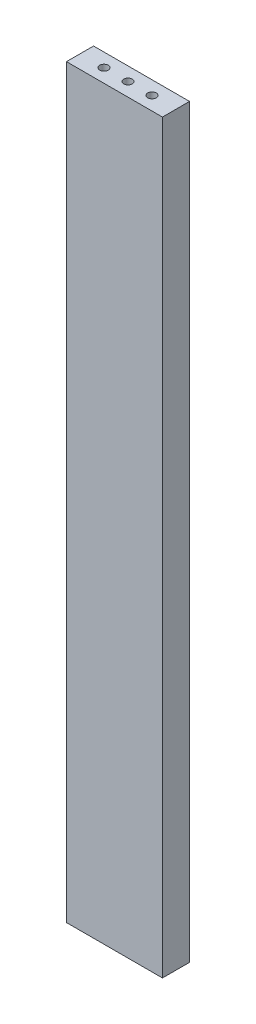
ISO-10303-21;
HEADER;
FILE_DESCRIPTION(('STEP AP214'),'2;1');
FILE_NAME('part.step','',(''),(''),'','','');
FILE_SCHEMA(('AUTOMOTIVE_DESIGN { 1 0 10303 214 1 1 1 1 }'));
ENDSEC;
DATA;
#1=APPLICATION_CONTEXT('core data for automotive mechanical design processes');
#2=APPLICATION_PROTOCOL_DEFINITION('international standard','automotive_design',2000,#1);
#3=PRODUCT_CONTEXT('',#1,'mechanical');
#4=PRODUCT('Part','Part','',(#3));
#5=PRODUCT_RELATED_PRODUCT_CATEGORY('part','',(#4));
#6=PRODUCT_DEFINITION_FORMATION('','',#4);
#7=PRODUCT_DEFINITION_CONTEXT('part definition',#1,'design');
#8=PRODUCT_DEFINITION('design','',#6,#7);
#9=PRODUCT_DEFINITION_SHAPE('','',#8);
#10=(LENGTH_UNIT() NAMED_UNIT(*) SI_UNIT(.MILLI.,.METRE.));
#11=(NAMED_UNIT(*) PLANE_ANGLE_UNIT() SI_UNIT($,.RADIAN.));
#12=(NAMED_UNIT(*) SI_UNIT($,.STERADIAN.) SOLID_ANGLE_UNIT());
#13=UNCERTAINTY_MEASURE_WITH_UNIT(LENGTH_MEASURE(1.E-05),#10,'distance_accuracy_value','');
#14=(GEOMETRIC_REPRESENTATION_CONTEXT(3) GLOBAL_UNCERTAINTY_ASSIGNED_CONTEXT((#13)) GLOBAL_UNIT_ASSIGNED_CONTEXT((#10,
#11,#12)) REPRESENTATION_CONTEXT('',''));
#15=CARTESIAN_POINT('',(0.,0.,0.));
#16=DIRECTION('',(0.,0.,1.));
#17=DIRECTION('',(1.,0.,0.));
#18=AXIS2_PLACEMENT_3D('',#15,#16,#17);
#19=CARTESIAN_POINT('',(45.,699.2,-12.7));
#20=DIRECTION('',(-1.,0.,0.));
#21=DIRECTION('',(0.,0.,1.));
#22=AXIS2_PLACEMENT_3D('',#19,#20,#21);
#23=PLANE('',#22);
#24=DIRECTION('',(0.,0.,-1.));
#25=VECTOR('',#24,1.);
#26=CARTESIAN_POINT('',(45.,0.,-12.7));
#27=LINE('',#26,#25);
#28=CARTESIAN_POINT('',(45.,0.,12.7));
#29=VERTEX_POINT('',#28);
#30=CARTESIAN_POINT('',(45.,0.,-12.7));
#31=VERTEX_POINT('',#30);
#32=EDGE_CURVE('E96',#29,#31,#27,.T.);
#33=ORIENTED_EDGE('',*,*,#32,.T.);
#34=DIRECTION('',(0.,-1.,0.));
#35=VECTOR('',#34,1.);
#36=CARTESIAN_POINT('',(45.,699.2,-12.7));
#37=LINE('',#36,#35);
#38=CARTESIAN_POINT('',(45.,699.2,-12.7));
#39=VERTEX_POINT('',#38);
#40=EDGE_CURVE('E11',#39,#31,#37,.T.);
#41=ORIENTED_EDGE('',*,*,#40,.F.);
#42=DIRECTION('',(0.,0.,-1.));
#43=VECTOR('',#42,1.);
#44=CARTESIAN_POINT('',(45.,699.2,-12.7));
#45=LINE('',#44,#43);
#46=CARTESIAN_POINT('',(45.,699.2,12.7));
#47=VERTEX_POINT('',#46);
#48=EDGE_CURVE('E84',#47,#39,#45,.T.);
#49=ORIENTED_EDGE('',*,*,#48,.F.);
#50=DIRECTION('',(0.,-1.,0.));
#51=VECTOR('',#50,1.);
#52=CARTESIAN_POINT('',(45.,699.2,12.7));
#53=LINE('',#52,#51);
#54=EDGE_CURVE('E92',#47,#29,#53,.T.);
#55=ORIENTED_EDGE('',*,*,#54,.T.);
#56=EDGE_LOOP('',(#33,#41,#49,#55));
#57=FACE_BOUND('',#56,.T.);
#58=ADVANCED_FACE('F33',(#57),#23,.F.);
#59=CARTESIAN_POINT('',(-45.,699.2,-12.7));
#60=DIRECTION('',(0.,0.,1.));
#61=DIRECTION('',(1.,0.,0.));
#62=AXIS2_PLACEMENT_3D('',#59,#60,#61);
#63=PLANE('',#62);
#64=DIRECTION('',(-1.,0.,0.));
#65=VECTOR('',#64,1.);
#66=CARTESIAN_POINT('',(-45.,0.,-12.7));
#67=LINE('',#66,#65);
#68=CARTESIAN_POINT('',(-45.,0.,-12.7));
#69=VERTEX_POINT('',#68);
#70=EDGE_CURVE('E88',#31,#69,#67,.T.);
#71=ORIENTED_EDGE('',*,*,#70,.T.);
#72=DIRECTION('',(0.,-1.,0.));
#73=VECTOR('',#72,1.);
#74=CARTESIAN_POINT('',(-45.,699.2,-12.7));
#75=LINE('',#74,#73);
#76=CARTESIAN_POINT('',(-45.,699.2,-12.7));
#77=VERTEX_POINT('',#76);
#78=EDGE_CURVE('E41',#77,#69,#75,.T.);
#79=ORIENTED_EDGE('',*,*,#78,.F.);
#80=DIRECTION('',(-1.,0.,0.));
#81=VECTOR('',#80,1.);
#82=CARTESIAN_POINT('',(-45.,699.2,-12.7));
#83=LINE('',#82,#81);
#84=EDGE_CURVE('E79',#39,#77,#83,.T.);
#85=ORIENTED_EDGE('',*,*,#84,.F.);
#86=ORIENTED_EDGE('',*,*,#40,.T.);
#87=EDGE_LOOP('',(#71,#79,#85,#86));
#88=FACE_BOUND('',#87,.T.);
#89=ADVANCED_FACE('F87',(#88),#63,.F.);
#90=CARTESIAN_POINT('',(-45.,699.2,-12.7));
#91=DIRECTION('',(1.,0.,0.));
#92=DIRECTION('',(0.,0.,-1.));
#93=AXIS2_PLACEMENT_3D('',#90,#91,#92);
#94=PLANE('',#93);
#95=DIRECTION('',(0.,0.,1.));
#96=VECTOR('',#95,1.);
#97=CARTESIAN_POINT('',(-45.,0.,-12.7));
#98=LINE('',#97,#96);
#99=CARTESIAN_POINT('',(-45.,0.,12.7));
#100=VERTEX_POINT('',#99);
#101=EDGE_CURVE('E66',#69,#100,#98,.T.);
#102=ORIENTED_EDGE('',*,*,#101,.T.);
#103=DIRECTION('',(0.,-1.,0.));
#104=VECTOR('',#103,1.);
#105=CARTESIAN_POINT('',(-45.,699.2,12.7));
#106=LINE('',#105,#104);
#107=CARTESIAN_POINT('',(-45.,699.2,12.7));
#108=VERTEX_POINT('',#107);
#109=EDGE_CURVE('E89',#108,#100,#106,.T.);
#110=ORIENTED_EDGE('',*,*,#109,.F.);
#111=DIRECTION('',(0.,0.,1.));
#112=VECTOR('',#111,1.);
#113=CARTESIAN_POINT('',(-45.,699.2,-12.7));
#114=LINE('',#113,#112);
#115=EDGE_CURVE('E82',#77,#108,#114,.T.);
#116=ORIENTED_EDGE('',*,*,#115,.F.);
#117=ORIENTED_EDGE('',*,*,#78,.T.);
#118=EDGE_LOOP('',(#102,#110,#116,#117));
#119=FACE_BOUND('',#118,.T.);
#120=ADVANCED_FACE('F90',(#119),#94,.F.);
#121=CARTESIAN_POINT('',(-45.,699.2,12.7));
#122=DIRECTION('',(0.,0.,-1.));
#123=DIRECTION('',(-1.,0.,0.));
#124=AXIS2_PLACEMENT_3D('',#121,#122,#123);
#125=PLANE('',#124);
#126=DIRECTION('',(1.,0.,0.));
#127=VECTOR('',#126,1.);
#128=CARTESIAN_POINT('',(-45.,0.,12.7));
#129=LINE('',#128,#127);
#130=EDGE_CURVE('E72',#100,#29,#129,.T.);
#131=ORIENTED_EDGE('',*,*,#130,.T.);
#132=ORIENTED_EDGE('',*,*,#54,.F.);
#133=DIRECTION('',(1.,0.,0.));
#134=VECTOR('',#133,1.);
#135=CARTESIAN_POINT('',(-45.,699.2,12.7));
#136=LINE('',#135,#134);
#137=EDGE_CURVE('E49',#108,#47,#136,.T.);
#138=ORIENTED_EDGE('',*,*,#137,.F.);
#139=ORIENTED_EDGE('',*,*,#109,.T.);
#140=EDGE_LOOP('',(#131,#132,#138,#139));
#141=FACE_BOUND('',#140,.T.);
#142=ADVANCED_FACE('F104',(#141),#125,.F.);
#143=CARTESIAN_POINT('',(0.,699.2,0.));
#144=DIRECTION('',(0.,1.,0.));
#145=DIRECTION('',(0.,0.,1.));
#146=AXIS2_PLACEMENT_3D('',#143,#144,#145);
#147=PLANE('',#146);
#148=CARTESIAN_POINT('',(-22.5,699.2,0.));
#149=DIRECTION('',(0.,1.,0.));
#150=DIRECTION('',(0.,0.,1.));
#151=AXIS2_PLACEMENT_3D('',#148,#149,#150);
#152=CIRCLE('',#151,4.);
#153=CARTESIAN_POINT('',(-22.5,699.2,4.));
#154=VERTEX_POINT('',#153);
#155=EDGE_CURVE('E122',#154,#154,#152,.T.);
#156=ORIENTED_EDGE('',*,*,#155,.F.);
#157=EDGE_LOOP('',(#156));
#158=FACE_BOUND('',#157,.T.);
#159=CARTESIAN_POINT('',(22.5,699.2,0.));
#160=DIRECTION('',(0.,1.,0.));
#161=DIRECTION('',(0.,0.,1.));
#162=AXIS2_PLACEMENT_3D('',#159,#160,#161);
#163=CIRCLE('',#162,4.);
#164=CARTESIAN_POINT('',(22.5,699.2,4.));
#165=VERTEX_POINT('',#164);
#166=EDGE_CURVE('E116',#165,#165,#163,.T.);
#167=ORIENTED_EDGE('',*,*,#166,.F.);
#168=EDGE_LOOP('',(#167));
#169=FACE_BOUND('',#168,.T.);
#170=CARTESIAN_POINT('',(0.,699.2,0.));
#171=DIRECTION('',(0.,1.,0.));
#172=DIRECTION('',(0.,0.,1.));
#173=AXIS2_PLACEMENT_3D('',#170,#171,#172);
#174=CIRCLE('',#173,4.);
#175=CARTESIAN_POINT('',(0.,699.2,4.));
#176=VERTEX_POINT('',#175);
#177=EDGE_CURVE('E110',#176,#176,#174,.T.);
#178=ORIENTED_EDGE('',*,*,#177,.F.);
#179=EDGE_LOOP('',(#178));
#180=FACE_BOUND('',#179,.T.);
#181=ORIENTED_EDGE('',*,*,#48,.T.);
#182=ORIENTED_EDGE('',*,*,#84,.T.);
#183=ORIENTED_EDGE('',*,*,#115,.T.);
#184=ORIENTED_EDGE('',*,*,#137,.T.);
#185=EDGE_LOOP('',(#181,#182,#183,#184));
#186=FACE_BOUND('',#185,.T.);
#187=ADVANCED_FACE('F80',(#158,#169,#180,#186),#147,.T.);
#188=CARTESIAN_POINT('',(0.,0.,0.));
#189=DIRECTION('',(0.,1.,0.));
#190=DIRECTION('',(0.,0.,1.));
#191=AXIS2_PLACEMENT_3D('',#188,#189,#190);
#192=PLANE('',#191);
#193=CARTESIAN_POINT('',(-22.5,0.,0.));
#194=DIRECTION('',(0.,-1.,0.));
#195=DIRECTION('',(0.,0.,-1.));
#196=AXIS2_PLACEMENT_3D('',#193,#194,#195);
#197=CIRCLE('',#196,4.);
#198=CARTESIAN_POINT('',(-22.5,0.,-4.));
#199=VERTEX_POINT('',#198);
#200=EDGE_CURVE('E140',#199,#199,#197,.T.);
#201=ORIENTED_EDGE('',*,*,#200,.F.);
#202=EDGE_LOOP('',(#201));
#203=FACE_BOUND('',#202,.T.);
#204=CARTESIAN_POINT('',(22.5,0.,0.));
#205=DIRECTION('',(0.,-1.,0.));
#206=DIRECTION('',(0.,0.,-1.));
#207=AXIS2_PLACEMENT_3D('',#204,#205,#206);
#208=CIRCLE('',#207,4.);
#209=CARTESIAN_POINT('',(22.5,0.,-4.));
#210=VERTEX_POINT('',#209);
#211=EDGE_CURVE('E134',#210,#210,#208,.T.);
#212=ORIENTED_EDGE('',*,*,#211,.F.);
#213=EDGE_LOOP('',(#212));
#214=FACE_BOUND('',#213,.T.);
#215=CARTESIAN_POINT('',(0.,0.,0.));
#216=DIRECTION('',(0.,-1.,0.));
#217=DIRECTION('',(0.,0.,-1.));
#218=AXIS2_PLACEMENT_3D('',#215,#216,#217);
#219=CIRCLE('',#218,4.);
#220=CARTESIAN_POINT('',(0.,0.,-4.));
#221=VERTEX_POINT('',#220);
#222=EDGE_CURVE('E128',#221,#221,#219,.T.);
#223=ORIENTED_EDGE('',*,*,#222,.F.);
#224=EDGE_LOOP('',(#223));
#225=FACE_BOUND('',#224,.T.);
#226=ORIENTED_EDGE('',*,*,#32,.F.);
#227=ORIENTED_EDGE('',*,*,#130,.F.);
#228=ORIENTED_EDGE('',*,*,#101,.F.);
#229=ORIENTED_EDGE('',*,*,#70,.F.);
#230=EDGE_LOOP('',(#226,#227,#228,#229));
#231=FACE_BOUND('',#230,.T.);
#232=ADVANCED_FACE('F107',(#203,#214,#225,#231),#192,.F.);
#233=CARTESIAN_POINT('',(0.,689.2,0.));
#234=DIRECTION('',(0.,1.,0.));
#235=DIRECTION('',(0.,0.,1.));
#236=AXIS2_PLACEMENT_3D('',#233,#234,#235);
#237=CYLINDRICAL_SURFACE('',#236,4.);
#238=CARTESIAN_POINT('',(0.,689.2,0.));
#239=DIRECTION('',(0.,1.,0.));
#240=DIRECTION('',(0.,0.,1.));
#241=AXIS2_PLACEMENT_3D('',#238,#239,#240);
#242=CIRCLE('',#241,4.);
#243=CARTESIAN_POINT('',(0.,689.2,4.));
#244=VERTEX_POINT('',#243);
#245=EDGE_CURVE('E99',#244,#244,#242,.T.);
#246=ORIENTED_EDGE('',*,*,#245,.F.);
#247=EDGE_LOOP('',(#246));
#248=FACE_BOUND('',#247,.T.);
#249=ORIENTED_EDGE('',*,*,#177,.T.);
#250=EDGE_LOOP('',(#249));
#251=FACE_BOUND('',#250,.T.);
#252=ADVANCED_FACE('F157',(#248,#251),#237,.F.);
#253=CARTESIAN_POINT('',(0.,689.2,0.));
#254=DIRECTION('',(0.,1.,0.));
#255=DIRECTION('',(0.,0.,1.));
#256=AXIS2_PLACEMENT_3D('',#253,#254,#255);
#257=PLANE('',#256);
#258=ORIENTED_EDGE('',*,*,#245,.T.);
#259=EDGE_LOOP('',(#258));
#260=FACE_BOUND('',#259,.T.);
#261=ADVANCED_FACE('F196',(#260),#257,.T.);
#262=CARTESIAN_POINT('',(22.5,689.2,0.));
#263=DIRECTION('',(0.,1.,0.));
#264=DIRECTION('',(0.,0.,1.));
#265=AXIS2_PLACEMENT_3D('',#262,#263,#264);
#266=CYLINDRICAL_SURFACE('',#265,4.);
#267=CARTESIAN_POINT('',(22.5,689.2,0.));
#268=DIRECTION('',(0.,1.,0.));
#269=DIRECTION('',(0.,0.,1.));
#270=AXIS2_PLACEMENT_3D('',#267,#268,#269);
#271=CIRCLE('',#270,4.);
#272=CARTESIAN_POINT('',(22.5,689.2,4.));
#273=VERTEX_POINT('',#272);
#274=EDGE_CURVE('E113',#273,#273,#271,.T.);
#275=ORIENTED_EDGE('',*,*,#274,.F.);
#276=EDGE_LOOP('',(#275));
#277=FACE_BOUND('',#276,.T.);
#278=ORIENTED_EDGE('',*,*,#166,.T.);
#279=EDGE_LOOP('',(#278));
#280=FACE_BOUND('',#279,.T.);
#281=ADVANCED_FACE('F200',(#277,#280),#266,.F.);
#282=CARTESIAN_POINT('',(22.5,689.2,0.));
#283=DIRECTION('',(0.,1.,0.));
#284=DIRECTION('',(0.,0.,1.));
#285=AXIS2_PLACEMENT_3D('',#282,#283,#284);
#286=PLANE('',#285);
#287=ORIENTED_EDGE('',*,*,#274,.T.);
#288=EDGE_LOOP('',(#287));
#289=FACE_BOUND('',#288,.T.);
#290=ADVANCED_FACE('F204',(#289),#286,.T.);
#291=CARTESIAN_POINT('',(-22.5,689.2,0.));
#292=DIRECTION('',(0.,1.,0.));
#293=DIRECTION('',(0.,0.,1.));
#294=AXIS2_PLACEMENT_3D('',#291,#292,#293);
#295=CYLINDRICAL_SURFACE('',#294,4.);
#296=CARTESIAN_POINT('',(-22.5,689.2,0.));
#297=DIRECTION('',(0.,1.,0.));
#298=DIRECTION('',(0.,0.,1.));
#299=AXIS2_PLACEMENT_3D('',#296,#297,#298);
#300=CIRCLE('',#299,4.);
#301=CARTESIAN_POINT('',(-22.5,689.2,4.));
#302=VERTEX_POINT('',#301);
#303=EDGE_CURVE('E119',#302,#302,#300,.T.);
#304=ORIENTED_EDGE('',*,*,#303,.F.);
#305=EDGE_LOOP('',(#304));
#306=FACE_BOUND('',#305,.T.);
#307=ORIENTED_EDGE('',*,*,#155,.T.);
#308=EDGE_LOOP('',(#307));
#309=FACE_BOUND('',#308,.T.);
#310=ADVANCED_FACE('F176',(#306,#309),#295,.F.);
#311=CARTESIAN_POINT('',(-22.5,689.2,0.));
#312=DIRECTION('',(0.,1.,0.));
#313=DIRECTION('',(0.,0.,1.));
#314=AXIS2_PLACEMENT_3D('',#311,#312,#313);
#315=PLANE('',#314);
#316=ORIENTED_EDGE('',*,*,#303,.T.);
#317=EDGE_LOOP('',(#316));
#318=FACE_BOUND('',#317,.T.);
#319=ADVANCED_FACE('F166',(#318),#315,.T.);
#320=CARTESIAN_POINT('',(0.,10.,0.));
#321=DIRECTION('',(0.,-1.,0.));
#322=DIRECTION('',(0.,0.,-1.));
#323=AXIS2_PLACEMENT_3D('',#320,#321,#322);
#324=CYLINDRICAL_SURFACE('',#323,4.);
#325=CARTESIAN_POINT('',(0.,10.,0.));
#326=DIRECTION('',(0.,-1.,0.));
#327=DIRECTION('',(0.,0.,-1.));
#328=AXIS2_PLACEMENT_3D('',#325,#326,#327);
#329=CIRCLE('',#328,4.);
#330=CARTESIAN_POINT('',(0.,10.,-4.));
#331=VERTEX_POINT('',#330);
#332=EDGE_CURVE('E125',#331,#331,#329,.T.);
#333=ORIENTED_EDGE('',*,*,#332,.F.);
#334=EDGE_LOOP('',(#333));
#335=FACE_BOUND('',#334,.T.);
#336=ORIENTED_EDGE('',*,*,#222,.T.);
#337=EDGE_LOOP('',(#336));
#338=FACE_BOUND('',#337,.T.);
#339=ADVANCED_FACE('F163',(#335,#338),#324,.F.);
#340=CARTESIAN_POINT('',(0.,10.,0.));
#341=DIRECTION('',(0.,-1.,0.));
#342=DIRECTION('',(0.,0.,-1.));
#343=AXIS2_PLACEMENT_3D('',#340,#341,#342);
#344=PLANE('',#343);
#345=ORIENTED_EDGE('',*,*,#332,.T.);
#346=EDGE_LOOP('',(#345));
#347=FACE_BOUND('',#346,.T.);
#348=ADVANCED_FACE('F165',(#347),#344,.T.);
#349=CARTESIAN_POINT('',(22.5,10.,0.));
#350=DIRECTION('',(0.,-1.,0.));
#351=DIRECTION('',(0.,0.,-1.));
#352=AXIS2_PLACEMENT_3D('',#349,#350,#351);
#353=CYLINDRICAL_SURFACE('',#352,4.);
#354=CARTESIAN_POINT('',(22.5,10.,0.));
#355=DIRECTION('',(0.,-1.,0.));
#356=DIRECTION('',(0.,0.,-1.));
#357=AXIS2_PLACEMENT_3D('',#354,#355,#356);
#358=CIRCLE('',#357,4.);
#359=CARTESIAN_POINT('',(22.5,10.,-4.));
#360=VERTEX_POINT('',#359);
#361=EDGE_CURVE('E131',#360,#360,#358,.T.);
#362=ORIENTED_EDGE('',*,*,#361,.F.);
#363=EDGE_LOOP('',(#362));
#364=FACE_BOUND('',#363,.T.);
#365=ORIENTED_EDGE('',*,*,#211,.T.);
#366=EDGE_LOOP('',(#365));
#367=FACE_BOUND('',#366,.T.);
#368=ADVANCED_FACE('F173',(#364,#367),#353,.F.);
#369=CARTESIAN_POINT('',(22.5,10.,0.));
#370=DIRECTION('',(0.,-1.,0.));
#371=DIRECTION('',(0.,0.,-1.));
#372=AXIS2_PLACEMENT_3D('',#369,#370,#371);
#373=PLANE('',#372);
#374=ORIENTED_EDGE('',*,*,#361,.T.);
#375=EDGE_LOOP('',(#374));
#376=FACE_BOUND('',#375,.T.);
#377=ADVANCED_FACE('F151',(#376),#373,.T.);
#378=CARTESIAN_POINT('',(-22.5,10.,0.));
#379=DIRECTION('',(0.,-1.,0.));
#380=DIRECTION('',(0.,0.,-1.));
#381=AXIS2_PLACEMENT_3D('',#378,#379,#380);
#382=CYLINDRICAL_SURFACE('',#381,4.);
#383=CARTESIAN_POINT('',(-22.5,10.,0.));
#384=DIRECTION('',(0.,-1.,0.));
#385=DIRECTION('',(0.,0.,-1.));
#386=AXIS2_PLACEMENT_3D('',#383,#384,#385);
#387=CIRCLE('',#386,4.);
#388=CARTESIAN_POINT('',(-22.5,10.,-4.));
#389=VERTEX_POINT('',#388);
#390=EDGE_CURVE('E137',#389,#389,#387,.T.);
#391=ORIENTED_EDGE('',*,*,#390,.F.);
#392=EDGE_LOOP('',(#391));
#393=FACE_BOUND('',#392,.T.);
#394=ORIENTED_EDGE('',*,*,#200,.T.);
#395=EDGE_LOOP('',(#394));
#396=FACE_BOUND('',#395,.T.);
#397=ADVANCED_FACE('F148',(#393,#396),#382,.F.);
#398=CARTESIAN_POINT('',(-22.5,10.,0.));
#399=DIRECTION('',(0.,-1.,0.));
#400=DIRECTION('',(0.,0.,-1.));
#401=AXIS2_PLACEMENT_3D('',#398,#399,#400);
#402=PLANE('',#401);
#403=ORIENTED_EDGE('',*,*,#390,.T.);
#404=EDGE_LOOP('',(#403));
#405=FACE_BOUND('',#404,.T.);
#406=ADVANCED_FACE('F146',(#405),#402,.T.);
#407=CLOSED_SHELL('',(#58,#89,#120,#142,#187,#232,#252,#261,#281,#290,#310,#319,#339,#348,#368,
#377,#397,#406));
#408=MANIFOLD_SOLID_BREP('B2',#407);
#409=ADVANCED_BREP_SHAPE_REPRESENTATION('',(#18,#408),#14);
#410=SHAPE_DEFINITION_REPRESENTATION(#9,#409);
ENDSEC;
END-ISO-10303-21;
